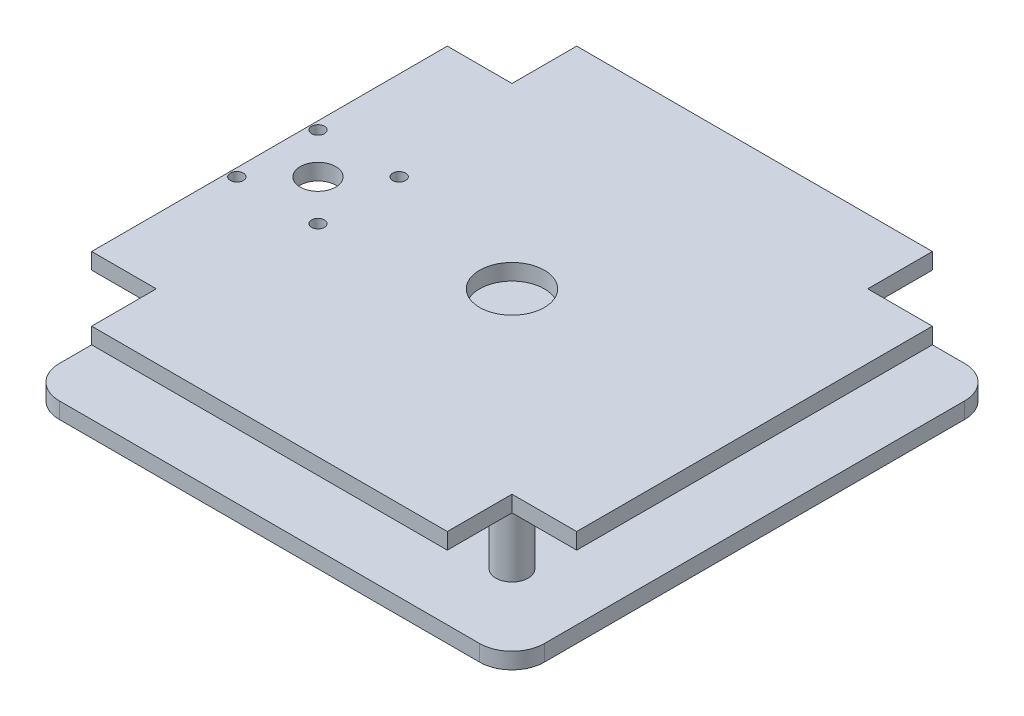
ISO-10303-21;
HEADER;
FILE_DESCRIPTION(('STEP AP214'),'2;1');
FILE_NAME('part.step','',(''),(''),'','','');
FILE_SCHEMA(('AUTOMOTIVE_DESIGN { 1 0 10303 214 1 1 1 1 }'));
ENDSEC;
DATA;
#1=APPLICATION_CONTEXT('core data for automotive mechanical design processes');
#2=APPLICATION_PROTOCOL_DEFINITION('international standard','automotive_design',2000,#1);
#3=PRODUCT_CONTEXT('',#1,'mechanical');
#4=PRODUCT('Part','Part','',(#3));
#5=PRODUCT_RELATED_PRODUCT_CATEGORY('part','',(#4));
#6=PRODUCT_DEFINITION_FORMATION('','',#4);
#7=PRODUCT_DEFINITION_CONTEXT('part definition',#1,'design');
#8=PRODUCT_DEFINITION('design','',#6,#7);
#9=PRODUCT_DEFINITION_SHAPE('','',#8);
#10=(LENGTH_UNIT() NAMED_UNIT(*) SI_UNIT(.MILLI.,.METRE.));
#11=(NAMED_UNIT(*) PLANE_ANGLE_UNIT() SI_UNIT($,.RADIAN.));
#12=(NAMED_UNIT(*) SI_UNIT($,.STERADIAN.) SOLID_ANGLE_UNIT());
#13=UNCERTAINTY_MEASURE_WITH_UNIT(LENGTH_MEASURE(1.E-05),#10,'distance_accuracy_value','');
#14=(GEOMETRIC_REPRESENTATION_CONTEXT(3) GLOBAL_UNCERTAINTY_ASSIGNED_CONTEXT((#13)) GLOBAL_UNIT_ASSIGNED_CONTEXT((#10,
#11,#12)) REPRESENTATION_CONTEXT('',''));
#15=CARTESIAN_POINT('',(0.,0.,0.));
#16=DIRECTION('',(0.,0.,1.));
#17=DIRECTION('',(1.,0.,0.));
#18=AXIS2_PLACEMENT_3D('',#15,#16,#17);
#19=CARTESIAN_POINT('',(75.,5.,-75.));
#20=DIRECTION('',(-1.,0.,0.));
#21=DIRECTION('',(0.,0.,1.));
#22=AXIS2_PLACEMENT_3D('',#19,#20,#21);
#23=PLANE('',#22);
#24=DIRECTION('',(0.,0.,-1.));
#25=VECTOR('',#24,1.);
#26=CARTESIAN_POINT('',(75.,5.,-75.));
#27=LINE('',#26,#25);
#28=CARTESIAN_POINT('',(75.,5.,65.));
#29=VERTEX_POINT('',#28);
#30=CARTESIAN_POINT('',(75.,5.,-65.));
#31=VERTEX_POINT('',#30);
#32=EDGE_CURVE('E267',#29,#31,#27,.T.);
#33=ORIENTED_EDGE('',*,*,#32,.F.);
#34=DIRECTION('',(0.,-1.,0.));
#35=VECTOR('',#34,1.);
#36=CARTESIAN_POINT('',(75.,5.,65.));
#37=LINE('',#36,#35);
#38=CARTESIAN_POINT('',(75.,0.,65.));
#39=VERTEX_POINT('',#38);
#40=EDGE_CURVE('E320',#29,#39,#37,.T.);
#41=ORIENTED_EDGE('',*,*,#40,.T.);
#42=DIRECTION('',(0.,0.,-1.));
#43=VECTOR('',#42,1.);
#44=CARTESIAN_POINT('',(75.,0.,-75.));
#45=LINE('',#44,#43);
#46=CARTESIAN_POINT('',(75.,0.,-65.));
#47=VERTEX_POINT('',#46);
#48=EDGE_CURVE('E264',#39,#47,#45,.T.);
#49=ORIENTED_EDGE('',*,*,#48,.T.);
#50=DIRECTION('',(0.,-1.,0.));
#51=VECTOR('',#50,1.);
#52=CARTESIAN_POINT('',(75.,5.,-65.));
#53=LINE('',#52,#51);
#54=EDGE_CURVE('E318',#47,#31,#53,.F.);
#55=ORIENTED_EDGE('',*,*,#54,.T.);
#56=EDGE_LOOP('',(#33,#41,#49,#55));
#57=FACE_BOUND('',#56,.T.);
#58=ADVANCED_FACE('F43',(#57),#23,.F.);
#59=CARTESIAN_POINT('',(-75.,5.,-75.));
#60=DIRECTION('',(0.,0.,1.));
#61=DIRECTION('',(1.,0.,0.));
#62=AXIS2_PLACEMENT_3D('',#59,#60,#61);
#63=PLANE('',#62);
#64=DIRECTION('',(-1.,0.,0.));
#65=VECTOR('',#64,1.);
#66=CARTESIAN_POINT('',(-75.,5.,-75.));
#67=LINE('',#66,#65);
#68=CARTESIAN_POINT('',(65.,5.,-75.));
#69=VERTEX_POINT('',#68);
#70=CARTESIAN_POINT('',(-65.,5.,-75.));
#71=VERTEX_POINT('',#70);
#72=EDGE_CURVE('E270',#69,#71,#67,.T.);
#73=ORIENTED_EDGE('',*,*,#72,.F.);
#74=DIRECTION('',(0.,-1.,0.));
#75=VECTOR('',#74,1.);
#76=CARTESIAN_POINT('',(65.,5.,-75.));
#77=LINE('',#76,#75);
#78=CARTESIAN_POINT('',(65.,0.,-75.));
#79=VERTEX_POINT('',#78);
#80=EDGE_CURVE('E325',#69,#79,#77,.T.);
#81=ORIENTED_EDGE('',*,*,#80,.T.);
#82=DIRECTION('',(-1.,0.,0.));
#83=VECTOR('',#82,1.);
#84=CARTESIAN_POINT('',(-75.,0.,-75.));
#85=LINE('',#84,#83);
#86=CARTESIAN_POINT('',(-65.,0.,-75.));
#87=VERTEX_POINT('',#86);
#88=EDGE_CURVE('E283',#79,#87,#85,.T.);
#89=ORIENTED_EDGE('',*,*,#88,.T.);
#90=DIRECTION('',(0.,-1.,0.));
#91=VECTOR('',#90,1.);
#92=CARTESIAN_POINT('',(-65.,5.,-75.));
#93=LINE('',#92,#91);
#94=EDGE_CURVE('E323',#87,#71,#93,.F.);
#95=ORIENTED_EDGE('',*,*,#94,.T.);
#96=EDGE_LOOP('',(#73,#81,#89,#95));
#97=FACE_BOUND('',#96,.T.);
#98=ADVANCED_FACE('F475',(#97),#63,.F.);
#99=CARTESIAN_POINT('',(-75.,5.,-75.));
#100=DIRECTION('',(1.,0.,0.));
#101=DIRECTION('',(0.,0.,-1.));
#102=AXIS2_PLACEMENT_3D('',#99,#100,#101);
#103=PLANE('',#102);
#104=DIRECTION('',(0.,0.,1.));
#105=VECTOR('',#104,1.);
#106=CARTESIAN_POINT('',(-75.,0.,-75.));
#107=LINE('',#106,#105);
#108=CARTESIAN_POINT('',(-75.,0.,-65.));
#109=VERTEX_POINT('',#108);
#110=CARTESIAN_POINT('',(-75.,0.,65.));
#111=VERTEX_POINT('',#110);
#112=EDGE_CURVE('E286',#109,#111,#107,.T.);
#113=ORIENTED_EDGE('',*,*,#112,.T.);
#114=DIRECTION('',(0.,-1.,0.));
#115=VECTOR('',#114,1.);
#116=CARTESIAN_POINT('',(-75.,5.,65.));
#117=LINE('',#116,#115);
#118=CARTESIAN_POINT('',(-75.,5.,65.));
#119=VERTEX_POINT('',#118);
#120=EDGE_CURVE('E308',#111,#119,#117,.F.);
#121=ORIENTED_EDGE('',*,*,#120,.T.);
#122=DIRECTION('',(0.,0.,1.));
#123=VECTOR('',#122,1.);
#124=CARTESIAN_POINT('',(-75.,5.,-75.));
#125=LINE('',#124,#123);
#126=CARTESIAN_POINT('',(-75.,5.,-65.));
#127=VERTEX_POINT('',#126);
#128=EDGE_CURVE('E274',#127,#119,#125,.T.);
#129=ORIENTED_EDGE('',*,*,#128,.F.);
#130=DIRECTION('',(0.,-1.,0.));
#131=VECTOR('',#130,1.);
#132=CARTESIAN_POINT('',(-75.,5.,-65.));
#133=LINE('',#132,#131);
#134=EDGE_CURVE('E305',#127,#109,#133,.T.);
#135=ORIENTED_EDGE('',*,*,#134,.T.);
#136=EDGE_LOOP('',(#113,#121,#129,#135));
#137=FACE_BOUND('',#136,.T.);
#138=ADVANCED_FACE('F478',(#137),#103,.F.);
#139=CARTESIAN_POINT('',(-75.,5.,75.));
#140=DIRECTION('',(0.,0.,-1.));
#141=DIRECTION('',(-1.,0.,0.));
#142=AXIS2_PLACEMENT_3D('',#139,#140,#141);
#143=PLANE('',#142);
#144=DIRECTION('',(1.,0.,0.));
#145=VECTOR('',#144,1.);
#146=CARTESIAN_POINT('',(-75.,5.,75.));
#147=LINE('',#146,#145);
#148=CARTESIAN_POINT('',(-65.,5.,75.));
#149=VERTEX_POINT('',#148);
#150=CARTESIAN_POINT('',(65.,5.,75.));
#151=VERTEX_POINT('',#150);
#152=EDGE_CURVE('E277',#149,#151,#147,.T.);
#153=ORIENTED_EDGE('',*,*,#152,.F.);
#154=DIRECTION('',(0.,-1.,0.));
#155=VECTOR('',#154,1.);
#156=CARTESIAN_POINT('',(-65.,5.,75.));
#157=LINE('',#156,#155);
#158=CARTESIAN_POINT('',(-65.,0.,75.));
#159=VERTEX_POINT('',#158);
#160=EDGE_CURVE('E294',#149,#159,#157,.T.);
#161=ORIENTED_EDGE('',*,*,#160,.T.);
#162=DIRECTION('',(1.,0.,0.));
#163=VECTOR('',#162,1.);
#164=CARTESIAN_POINT('',(-75.,0.,75.));
#165=LINE('',#164,#163);
#166=CARTESIAN_POINT('',(65.,0.,75.));
#167=VERTEX_POINT('',#166);
#168=EDGE_CURVE('E271',#159,#167,#165,.T.);
#169=ORIENTED_EDGE('',*,*,#168,.T.);
#170=DIRECTION('',(0.,-1.,0.));
#171=VECTOR('',#170,1.);
#172=CARTESIAN_POINT('',(65.,5.,75.));
#173=LINE('',#172,#171);
#174=EDGE_CURVE('E280',#167,#151,#173,.F.);
#175=ORIENTED_EDGE('',*,*,#174,.T.);
#176=EDGE_LOOP('',(#153,#161,#169,#175));
#177=FACE_BOUND('',#176,.T.);
#178=ADVANCED_FACE('F436',(#177),#143,.F.);
#179=CARTESIAN_POINT('',(0.,5.,0.));
#180=DIRECTION('',(0.,1.,0.));
#181=DIRECTION('',(0.,0.,1.));
#182=AXIS2_PLACEMENT_3D('',#179,#180,#181);
#183=PLANE('',#182);
#184=CARTESIAN_POINT('',(-60.,5.,0.));
#185=DIRECTION('',(0.,1.,0.));
#186=DIRECTION('',(0.,0.,1.));
#187=AXIS2_PLACEMENT_3D('',#184,#185,#186);
#188=CIRCLE('',#187,5.5);
#189=CARTESIAN_POINT('',(-60.,5.,5.5));
#190=VERTEX_POINT('',#189);
#191=EDGE_CURVE('E224',#190,#190,#188,.T.);
#192=ORIENTED_EDGE('',*,*,#191,.F.);
#193=EDGE_LOOP('',(#192));
#194=FACE_BOUND('',#193,.T.);
#195=CARTESIAN_POINT('',(0.,5.,0.));
#196=DIRECTION('',(0.,1.,0.));
#197=DIRECTION('',(0.,0.,1.));
#198=AXIS2_PLACEMENT_3D('',#195,#196,#197);
#199=CIRCLE('',#198,10.);
#200=CARTESIAN_POINT('',(0.,5.,10.));
#201=VERTEX_POINT('',#200);
#202=EDGE_CURVE('E240',#201,#201,#199,.T.);
#203=ORIENTED_EDGE('',*,*,#202,.F.);
#204=EDGE_LOOP('',(#203));
#205=FACE_BOUND('',#204,.T.);
#206=CARTESIAN_POINT('',(-50.,5.,-49.9999999999972));
#207=DIRECTION('',(0.,1.,0.));
#208=DIRECTION('',(0.,0.,1.));
#209=AXIS2_PLACEMENT_3D('',#206,#207,#208);
#210=CIRCLE('',#209,5.000000000003);
#211=CARTESIAN_POINT('',(-50.,5.,-44.9999999999942));
#212=VERTEX_POINT('',#211);
#213=EDGE_CURVE('E239',#212,#212,#210,.T.);
#214=ORIENTED_EDGE('',*,*,#213,.F.);
#215=EDGE_LOOP('',(#214));
#216=FACE_BOUND('',#215,.T.);
#217=CARTESIAN_POINT('',(-49.9999999999972,5.,50.0000000000028));
#218=DIRECTION('',(0.,1.,0.));
#219=DIRECTION('',(0.,0.,1.));
#220=AXIS2_PLACEMENT_3D('',#217,#218,#219);
#221=CIRCLE('',#220,5.00000000000206);
#222=CARTESIAN_POINT('',(-49.9999999999972,5.,55.0000000000049));
#223=VERTEX_POINT('',#222);
#224=EDGE_CURVE('E246',#223,#223,#221,.T.);
#225=ORIENTED_EDGE('',*,*,#224,.F.);
#226=EDGE_LOOP('',(#225));
#227=FACE_BOUND('',#226,.T.);
#228=CARTESIAN_POINT('',(50.0000000000028,5.,50.));
#229=DIRECTION('',(0.,1.,0.));
#230=DIRECTION('',(0.,0.,1.));
#231=AXIS2_PLACEMENT_3D('',#228,#229,#230);
#232=CIRCLE('',#231,4.99999999999929);
#233=CARTESIAN_POINT('',(50.0000000000028,5.,54.9999999999993));
#234=VERTEX_POINT('',#233);
#235=EDGE_CURVE('E252',#234,#234,#232,.T.);
#236=ORIENTED_EDGE('',*,*,#235,.F.);
#237=EDGE_LOOP('',(#236));
#238=FACE_BOUND('',#237,.T.);
#239=CARTESIAN_POINT('',(50.,5.,-50.));
#240=DIRECTION('',(0.,1.,0.));
#241=DIRECTION('',(0.,0.,1.));
#242=AXIS2_PLACEMENT_3D('',#239,#240,#241);
#243=CIRCLE('',#242,5.);
#244=CARTESIAN_POINT('',(50.,5.,-45.));
#245=VERTEX_POINT('',#244);
#246=EDGE_CURVE('E258',#245,#245,#243,.T.);
#247=ORIENTED_EDGE('',*,*,#246,.F.);
#248=EDGE_LOOP('',(#247));
#249=FACE_BOUND('',#248,.T.);
#250=ORIENTED_EDGE('',*,*,#128,.T.);
#251=CARTESIAN_POINT('',(-65.,5.,65.));
#252=DIRECTION('',(0.,1.,0.));
#253=DIRECTION('',(0.,0.,1.));
#254=AXIS2_PLACEMENT_3D('',#251,#252,#253);
#255=CIRCLE('',#254,10.);
#256=EDGE_CURVE('E316',#119,#149,#255,.T.);
#257=ORIENTED_EDGE('',*,*,#256,.T.);
#258=ORIENTED_EDGE('',*,*,#152,.T.);
#259=CARTESIAN_POINT('',(65.,5.,65.));
#260=DIRECTION('',(0.,1.,0.));
#261=DIRECTION('',(0.,0.,1.));
#262=AXIS2_PLACEMENT_3D('',#259,#260,#261);
#263=CIRCLE('',#262,10.);
#264=EDGE_CURVE('E314',#151,#29,#263,.T.);
#265=ORIENTED_EDGE('',*,*,#264,.T.);
#266=ORIENTED_EDGE('',*,*,#32,.T.);
#267=CARTESIAN_POINT('',(65.,5.,-65.));
#268=DIRECTION('',(0.,1.,0.));
#269=DIRECTION('',(0.,0.,1.));
#270=AXIS2_PLACEMENT_3D('',#267,#268,#269);
#271=CIRCLE('',#270,10.);
#272=EDGE_CURVE('E312',#31,#69,#271,.T.);
#273=ORIENTED_EDGE('',*,*,#272,.T.);
#274=ORIENTED_EDGE('',*,*,#72,.T.);
#275=CARTESIAN_POINT('',(-65.,5.,-65.));
#276=DIRECTION('',(0.,1.,0.));
#277=DIRECTION('',(0.,0.,1.));
#278=AXIS2_PLACEMENT_3D('',#275,#276,#277);
#279=CIRCLE('',#278,10.);
#280=EDGE_CURVE('E310',#71,#127,#279,.T.);
#281=ORIENTED_EDGE('',*,*,#280,.T.);
#282=EDGE_LOOP('',(#250,#257,#258,#265,#266,#273,#274,#281));
#283=FACE_BOUND('',#282,.T.);
#284=ADVANCED_FACE('F432',(#194,#205,#216,#227,#238,#249,#283),#183,.T.);
#285=CARTESIAN_POINT('',(0.,0.,0.));
#286=DIRECTION('',(0.,1.,0.));
#287=DIRECTION('',(0.,0.,1.));
#288=AXIS2_PLACEMENT_3D('',#285,#286,#287);
#289=PLANE('',#288);
#290=CARTESIAN_POINT('',(-60.,0.,0.));
#291=DIRECTION('',(0.,1.,0.));
#292=DIRECTION('',(0.,0.,1.));
#293=AXIS2_PLACEMENT_3D('',#290,#291,#292);
#294=CIRCLE('',#293,5.5);
#295=CARTESIAN_POINT('',(-60.,0.,5.5));
#296=VERTEX_POINT('',#295);
#297=EDGE_CURVE('E235',#296,#296,#294,.T.);
#298=ORIENTED_EDGE('',*,*,#297,.T.);
#299=EDGE_LOOP('',(#298));
#300=FACE_BOUND('',#299,.T.);
#301=CARTESIAN_POINT('',(0.,0.,0.));
#302=DIRECTION('',(0.,1.,0.));
#303=DIRECTION('',(0.,0.,1.));
#304=AXIS2_PLACEMENT_3D('',#301,#302,#303);
#305=CIRCLE('',#304,10.);
#306=CARTESIAN_POINT('',(0.,0.,10.));
#307=VERTEX_POINT('',#306);
#308=EDGE_CURVE('E236',#307,#307,#305,.T.);
#309=ORIENTED_EDGE('',*,*,#308,.T.);
#310=EDGE_LOOP('',(#309));
#311=FACE_BOUND('',#310,.T.);
#312=ORIENTED_EDGE('',*,*,#168,.F.);
#313=CARTESIAN_POINT('',(-65.,0.,65.));
#314=DIRECTION('',(0.,1.,0.));
#315=DIRECTION('',(0.,0.,1.));
#316=AXIS2_PLACEMENT_3D('',#313,#314,#315);
#317=CIRCLE('',#316,10.);
#318=EDGE_CURVE('E303',#159,#111,#317,.F.);
#319=ORIENTED_EDGE('',*,*,#318,.T.);
#320=ORIENTED_EDGE('',*,*,#112,.F.);
#321=CARTESIAN_POINT('',(-65.,0.,-65.));
#322=DIRECTION('',(0.,1.,0.));
#323=DIRECTION('',(0.,0.,1.));
#324=AXIS2_PLACEMENT_3D('',#321,#322,#323);
#325=CIRCLE('',#324,10.);
#326=EDGE_CURVE('E297',#109,#87,#325,.F.);
#327=ORIENTED_EDGE('',*,*,#326,.T.);
#328=ORIENTED_EDGE('',*,*,#88,.F.);
#329=CARTESIAN_POINT('',(65.,0.,-65.));
#330=DIRECTION('',(0.,1.,0.));
#331=DIRECTION('',(0.,0.,1.));
#332=AXIS2_PLACEMENT_3D('',#329,#330,#331);
#333=CIRCLE('',#332,10.);
#334=EDGE_CURVE('E299',#79,#47,#333,.F.);
#335=ORIENTED_EDGE('',*,*,#334,.T.);
#336=ORIENTED_EDGE('',*,*,#48,.F.);
#337=CARTESIAN_POINT('',(65.,0.,65.));
#338=DIRECTION('',(0.,1.,0.));
#339=DIRECTION('',(0.,0.,1.));
#340=AXIS2_PLACEMENT_3D('',#337,#338,#339);
#341=CIRCLE('',#340,10.);
#342=EDGE_CURVE('E301',#39,#167,#341,.F.);
#343=ORIENTED_EDGE('',*,*,#342,.T.);
#344=EDGE_LOOP('',(#312,#319,#320,#327,#328,#335,#336,#343));
#345=FACE_BOUND('',#344,.T.);
#346=ADVANCED_FACE('F435',(#300,#311,#345),#289,.F.);
#347=CARTESIAN_POINT('',(50.,25.,-50.));
#348=DIRECTION('',(0.,-1.,0.));
#349=DIRECTION('',(0.,0.,-1.));
#350=AXIS2_PLACEMENT_3D('',#347,#348,#349);
#351=CYLINDRICAL_SURFACE('',#350,5.);
#352=CARTESIAN_POINT('',(50.,25.,-50.));
#353=DIRECTION('',(0.,1.,0.));
#354=DIRECTION('',(0.,0.,1.));
#355=AXIS2_PLACEMENT_3D('',#352,#353,#354);
#356=CIRCLE('',#355,5.);
#357=CARTESIAN_POINT('',(50.,25.,-45.));
#358=VERTEX_POINT('',#357);
#359=EDGE_CURVE('E261',#358,#358,#356,.T.);
#360=ORIENTED_EDGE('',*,*,#359,.F.);
#361=EDGE_LOOP('',(#360));
#362=FACE_BOUND('',#361,.T.);
#363=ORIENTED_EDGE('',*,*,#246,.T.);
#364=EDGE_LOOP('',(#363));
#365=FACE_BOUND('',#364,.T.);
#366=ADVANCED_FACE('F524',(#362,#365),#351,.T.);
#367=CARTESIAN_POINT('',(50.0000000000028,25.,50.));
#368=DIRECTION('',(0.,-1.,0.));
#369=DIRECTION('',(0.,0.,-1.));
#370=AXIS2_PLACEMENT_3D('',#367,#368,#369);
#371=CYLINDRICAL_SURFACE('',#370,4.99999999999929);
#372=CARTESIAN_POINT('',(50.0000000000028,25.,50.));
#373=DIRECTION('',(0.,1.,0.));
#374=DIRECTION('',(0.,0.,1.));
#375=AXIS2_PLACEMENT_3D('',#372,#373,#374);
#376=CIRCLE('',#375,4.99999999999929);
#377=CARTESIAN_POINT('',(50.0000000000028,25.,54.9999999999993));
#378=VERTEX_POINT('',#377);
#379=EDGE_CURVE('E255',#378,#378,#376,.T.);
#380=ORIENTED_EDGE('',*,*,#379,.F.);
#381=EDGE_LOOP('',(#380));
#382=FACE_BOUND('',#381,.T.);
#383=ORIENTED_EDGE('',*,*,#235,.T.);
#384=EDGE_LOOP('',(#383));
#385=FACE_BOUND('',#384,.T.);
#386=ADVANCED_FACE('F520',(#382,#385),#371,.T.);
#387=CARTESIAN_POINT('',(-49.9999999999972,25.,50.0000000000028));
#388=DIRECTION('',(0.,-1.,0.));
#389=DIRECTION('',(0.,0.,-1.));
#390=AXIS2_PLACEMENT_3D('',#387,#388,#389);
#391=CYLINDRICAL_SURFACE('',#390,5.00000000000206);
#392=CARTESIAN_POINT('',(-49.9999999999972,25.,50.0000000000028));
#393=DIRECTION('',(0.,1.,0.));
#394=DIRECTION('',(0.,0.,1.));
#395=AXIS2_PLACEMENT_3D('',#392,#393,#394);
#396=CIRCLE('',#395,5.00000000000206);
#397=CARTESIAN_POINT('',(-49.9999999999972,25.,55.0000000000049));
#398=VERTEX_POINT('',#397);
#399=EDGE_CURVE('E249',#398,#398,#396,.T.);
#400=ORIENTED_EDGE('',*,*,#399,.F.);
#401=EDGE_LOOP('',(#400));
#402=FACE_BOUND('',#401,.T.);
#403=ORIENTED_EDGE('',*,*,#224,.T.);
#404=EDGE_LOOP('',(#403));
#405=FACE_BOUND('',#404,.T.);
#406=ADVANCED_FACE('F428',(#402,#405),#391,.T.);
#407=CARTESIAN_POINT('',(-50.,25.,-49.9999999999972));
#408=DIRECTION('',(0.,-1.,0.));
#409=DIRECTION('',(0.,0.,-1.));
#410=AXIS2_PLACEMENT_3D('',#407,#408,#409);
#411=CYLINDRICAL_SURFACE('',#410,5.000000000003);
#412=CARTESIAN_POINT('',(-50.,25.,-49.9999999999972));
#413=DIRECTION('',(0.,1.,0.));
#414=DIRECTION('',(0.,0.,1.));
#415=AXIS2_PLACEMENT_3D('',#412,#413,#414);
#416=CIRCLE('',#415,5.000000000003);
#417=CARTESIAN_POINT('',(-50.,25.,-44.9999999999942));
#418=VERTEX_POINT('',#417);
#419=EDGE_CURVE('E243',#418,#418,#416,.T.);
#420=ORIENTED_EDGE('',*,*,#419,.F.);
#421=EDGE_LOOP('',(#420));
#422=FACE_BOUND('',#421,.T.);
#423=ORIENTED_EDGE('',*,*,#213,.T.);
#424=EDGE_LOOP('',(#423));
#425=FACE_BOUND('',#424,.T.);
#426=ADVANCED_FACE('F424',(#422,#425),#411,.T.);
#427=CARTESIAN_POINT('',(0.,0.,0.));
#428=DIRECTION('',(0.,1.,0.));
#429=DIRECTION('',(0.,0.,1.));
#430=AXIS2_PLACEMENT_3D('',#427,#428,#429);
#431=CYLINDRICAL_SURFACE('',#430,10.);
#432=ORIENTED_EDGE('',*,*,#308,.F.);
#433=EDGE_LOOP('',(#432));
#434=FACE_BOUND('',#433,.T.);
#435=ORIENTED_EDGE('',*,*,#202,.T.);
#436=EDGE_LOOP('',(#435));
#437=FACE_BOUND('',#436,.T.);
#438=ADVANCED_FACE('F427',(#434,#437),#431,.F.);
#439=CARTESIAN_POINT('',(-60.,-15.,0.));
#440=DIRECTION('',(0.,1.,0.));
#441=DIRECTION('',(0.,0.,1.));
#442=AXIS2_PLACEMENT_3D('',#439,#440,#441);
#443=CYLINDRICAL_SURFACE('',#442,5.5);
#444=ORIENTED_EDGE('',*,*,#191,.T.);
#445=EDGE_LOOP('',(#444));
#446=FACE_BOUND('',#445,.T.);
#447=ORIENTED_EDGE('',*,*,#297,.F.);
#448=EDGE_LOOP('',(#447));
#449=FACE_BOUND('',#448,.T.);
#450=ADVANCED_FACE('F494',(#446,#449),#443,.F.);
#451=CARTESIAN_POINT('',(-65.,5.,65.));
#452=DIRECTION('',(0.,-1.,0.));
#453=DIRECTION('',(0.,0.,-1.));
#454=AXIS2_PLACEMENT_3D('',#451,#452,#453);
#455=CYLINDRICAL_SURFACE('',#454,10.);
#456=ORIENTED_EDGE('',*,*,#256,.F.);
#457=ORIENTED_EDGE('',*,*,#120,.F.);
#458=ORIENTED_EDGE('',*,*,#318,.F.);
#459=ORIENTED_EDGE('',*,*,#160,.F.);
#460=EDGE_LOOP('',(#456,#457,#458,#459));
#461=FACE_BOUND('',#460,.T.);
#462=ADVANCED_FACE('F454',(#461),#455,.T.);
#463=CARTESIAN_POINT('',(65.,5.,65.));
#464=DIRECTION('',(0.,-1.,0.));
#465=DIRECTION('',(0.,0.,-1.));
#466=AXIS2_PLACEMENT_3D('',#463,#464,#465);
#467=CYLINDRICAL_SURFACE('',#466,10.);
#468=ORIENTED_EDGE('',*,*,#264,.F.);
#469=ORIENTED_EDGE('',*,*,#174,.F.);
#470=ORIENTED_EDGE('',*,*,#342,.F.);
#471=ORIENTED_EDGE('',*,*,#40,.F.);
#472=EDGE_LOOP('',(#468,#469,#470,#471));
#473=FACE_BOUND('',#472,.T.);
#474=ADVANCED_FACE('F464',(#473),#467,.T.);
#475=CARTESIAN_POINT('',(65.,5.,-65.));
#476=DIRECTION('',(0.,-1.,0.));
#477=DIRECTION('',(0.,0.,-1.));
#478=AXIS2_PLACEMENT_3D('',#475,#476,#477);
#479=CYLINDRICAL_SURFACE('',#478,10.);
#480=ORIENTED_EDGE('',*,*,#272,.F.);
#481=ORIENTED_EDGE('',*,*,#54,.F.);
#482=ORIENTED_EDGE('',*,*,#334,.F.);
#483=ORIENTED_EDGE('',*,*,#80,.F.);
#484=EDGE_LOOP('',(#480,#481,#482,#483));
#485=FACE_BOUND('',#484,.T.);
#486=ADVANCED_FACE('F472',(#485),#479,.T.);
#487=CARTESIAN_POINT('',(-65.,5.,-65.));
#488=DIRECTION('',(0.,-1.,0.));
#489=DIRECTION('',(0.,0.,-1.));
#490=AXIS2_PLACEMENT_3D('',#487,#488,#489);
#491=CYLINDRICAL_SURFACE('',#490,10.);
#492=ORIENTED_EDGE('',*,*,#280,.F.);
#493=ORIENTED_EDGE('',*,*,#94,.F.);
#494=ORIENTED_EDGE('',*,*,#326,.F.);
#495=ORIENTED_EDGE('',*,*,#134,.F.);
#496=EDGE_LOOP('',(#492,#493,#494,#495));
#497=FACE_BOUND('',#496,.T.);
#498=ADVANCED_FACE('F45',(#497),#491,.T.);
#499=CARTESIAN_POINT('',(0.,30.,-75.));
#500=DIRECTION('',(0.,0.,1.));
#501=DIRECTION('',(1.,0.,0.));
#502=AXIS2_PLACEMENT_3D('',#499,#500,#501);
#503=PLANE('',#502);
#504=DIRECTION('',(-1.,0.,0.));
#505=VECTOR('',#504,1.);
#506=CARTESIAN_POINT('',(0.,30.,-75.));
#507=LINE('',#506,#505);
#508=CARTESIAN_POINT('',(55.,30.,-75.0000000000125));
#509=VERTEX_POINT('',#508);
#510=CARTESIAN_POINT('',(-55.,30.,-75.));
#511=VERTEX_POINT('',#510);
#512=EDGE_CURVE('E200',#509,#511,#507,.T.);
#513=ORIENTED_EDGE('',*,*,#512,.F.);
#514=DIRECTION('',(0.,1.,0.));
#515=VECTOR('',#514,1.);
#516=CARTESIAN_POINT('',(55.,20.,-75.0000000000125));
#517=LINE('',#516,#515);
#518=CARTESIAN_POINT('',(55.,25.,-75.0000000000125));
#519=VERTEX_POINT('',#518);
#520=EDGE_CURVE('E180',#519,#509,#517,.T.);
#521=ORIENTED_EDGE('',*,*,#520,.F.);
#522=DIRECTION('',(-1.,0.,0.));
#523=VECTOR('',#522,1.);
#524=CARTESIAN_POINT('',(0.,25.,-75.));
#525=LINE('',#524,#523);
#526=CARTESIAN_POINT('',(-55.,25.,-75.));
#527=VERTEX_POINT('',#526);
#528=EDGE_CURVE('E225',#519,#527,#525,.T.);
#529=ORIENTED_EDGE('',*,*,#528,.T.);
#530=DIRECTION('',(0.,1.,0.));
#531=VECTOR('',#530,1.);
#532=CARTESIAN_POINT('',(-55.,20.,-75.));
#533=LINE('',#532,#531);
#534=EDGE_CURVE('E206',#527,#511,#533,.T.);
#535=ORIENTED_EDGE('',*,*,#534,.T.);
#536=EDGE_LOOP('',(#513,#521,#529,#535));
#537=FACE_BOUND('',#536,.T.);
#538=ADVANCED_FACE('F205',(#537),#503,.F.);
#539=CARTESIAN_POINT('',(-75.,30.,0.));
#540=DIRECTION('',(1.,0.,0.));
#541=DIRECTION('',(0.,0.,-1.));
#542=AXIS2_PLACEMENT_3D('',#539,#540,#541);
#543=PLANE('',#542);
#544=DIRECTION('',(0.,0.,1.));
#545=VECTOR('',#544,1.);
#546=CARTESIAN_POINT('',(-75.,25.,0.));
#547=LINE('',#546,#545);
#548=CARTESIAN_POINT('',(-75.,25.,-55.));
#549=VERTEX_POINT('',#548);
#550=CARTESIAN_POINT('',(-74.9999999999875,25.,55.));
#551=VERTEX_POINT('',#550);
#552=EDGE_CURVE('E227',#549,#551,#547,.T.);
#553=ORIENTED_EDGE('',*,*,#552,.T.);
#554=DIRECTION('',(0.,1.,0.));
#555=VECTOR('',#554,1.);
#556=CARTESIAN_POINT('',(-74.9999999999875,20.,55.));
#557=LINE('',#556,#555);
#558=CARTESIAN_POINT('',(-74.9999999999875,30.,55.));
#559=VERTEX_POINT('',#558);
#560=EDGE_CURVE('E358',#551,#559,#557,.T.);
#561=ORIENTED_EDGE('',*,*,#560,.T.);
#562=DIRECTION('',(0.,0.,1.));
#563=VECTOR('',#562,1.);
#564=CARTESIAN_POINT('',(-75.,30.,0.));
#565=LINE('',#564,#563);
#566=CARTESIAN_POINT('',(-75.,30.,-55.));
#567=VERTEX_POINT('',#566);
#568=EDGE_CURVE('E207',#567,#559,#565,.T.);
#569=ORIENTED_EDGE('',*,*,#568,.F.);
#570=DIRECTION('',(0.,1.,0.));
#571=VECTOR('',#570,1.);
#572=CARTESIAN_POINT('',(-75.,20.,-55.));
#573=LINE('',#572,#571);
#574=EDGE_CURVE('E370',#549,#567,#573,.T.);
#575=ORIENTED_EDGE('',*,*,#574,.F.);
#576=EDGE_LOOP('',(#553,#561,#569,#575));
#577=FACE_BOUND('',#576,.T.);
#578=ADVANCED_FACE('F503',(#577),#543,.F.);
#579=CARTESIAN_POINT('',(0.,30.,75.));
#580=DIRECTION('',(0.,0.,-1.));
#581=DIRECTION('',(-1.,0.,0.));
#582=AXIS2_PLACEMENT_3D('',#579,#580,#581);
#583=PLANE('',#582);
#584=DIRECTION('',(1.,0.,0.));
#585=VECTOR('',#584,1.);
#586=CARTESIAN_POINT('',(0.,30.,75.));
#587=LINE('',#586,#585);
#588=CARTESIAN_POINT('',(-54.9999999999875,30.,75.0000000000001));
#589=VERTEX_POINT('',#588);
#590=CARTESIAN_POINT('',(55.0000000000125,30.,74.9999999999876));
#591=VERTEX_POINT('',#590);
#592=EDGE_CURVE('E211',#589,#591,#587,.T.);
#593=ORIENTED_EDGE('',*,*,#592,.F.);
#594=DIRECTION('',(0.,1.,0.));
#595=VECTOR('',#594,1.);
#596=CARTESIAN_POINT('',(-54.9999999999875,20.,75.0000000000001));
#597=LINE('',#596,#595);
#598=CARTESIAN_POINT('',(-54.9999999999875,25.,75.0000000000001));
#599=VERTEX_POINT('',#598);
#600=EDGE_CURVE('E350',#599,#589,#597,.T.);
#601=ORIENTED_EDGE('',*,*,#600,.F.);
#602=DIRECTION('',(1.,0.,0.));
#603=VECTOR('',#602,1.);
#604=CARTESIAN_POINT('',(0.,25.,75.));
#605=LINE('',#604,#603);
#606=CARTESIAN_POINT('',(55.0000000000125,25.,74.9999999999876));
#607=VERTEX_POINT('',#606);
#608=EDGE_CURVE('E214',#599,#607,#605,.T.);
#609=ORIENTED_EDGE('',*,*,#608,.T.);
#610=DIRECTION('',(0.,1.,0.));
#611=VECTOR('',#610,1.);
#612=CARTESIAN_POINT('',(55.0000000000125,20.,74.9999999999876));
#613=LINE('',#612,#611);
#614=EDGE_CURVE('E202',#607,#591,#613,.T.);
#615=ORIENTED_EDGE('',*,*,#614,.T.);
#616=EDGE_LOOP('',(#593,#601,#609,#615));
#617=FACE_BOUND('',#616,.T.);
#618=ADVANCED_FACE('F354',(#617),#583,.F.);
#619=CARTESIAN_POINT('',(75.,30.,0.));
#620=DIRECTION('',(-1.,0.,0.));
#621=DIRECTION('',(0.,0.,1.));
#622=AXIS2_PLACEMENT_3D('',#619,#620,#621);
#623=PLANE('',#622);
#624=DIRECTION('',(0.,0.,-1.));
#625=VECTOR('',#624,1.);
#626=CARTESIAN_POINT('',(75.,30.,0.));
#627=LINE('',#626,#625);
#628=CARTESIAN_POINT('',(75.0000000000125,30.,54.9999999999875));
#629=VERTEX_POINT('',#628);
#630=CARTESIAN_POINT('',(75.,30.,-55.0000000000125));
#631=VERTEX_POINT('',#630);
#632=EDGE_CURVE('E222',#629,#631,#627,.T.);
#633=ORIENTED_EDGE('',*,*,#632,.F.);
#634=DIRECTION('',(0.,1.,0.));
#635=VECTOR('',#634,1.);
#636=CARTESIAN_POINT('',(75.0000000000125,20.,54.9999999999875));
#637=LINE('',#636,#635);
#638=CARTESIAN_POINT('',(75.0000000000125,25.,54.9999999999875));
#639=VERTEX_POINT('',#638);
#640=EDGE_CURVE('E771',#639,#629,#637,.T.);
#641=ORIENTED_EDGE('',*,*,#640,.F.);
#642=DIRECTION('',(0.,0.,-1.));
#643=VECTOR('',#642,1.);
#644=CARTESIAN_POINT('',(75.,25.,0.));
#645=LINE('',#644,#643);
#646=CARTESIAN_POINT('',(75.,25.,-55.0000000000125));
#647=VERTEX_POINT('',#646);
#648=EDGE_CURVE('E208',#639,#647,#645,.T.);
#649=ORIENTED_EDGE('',*,*,#648,.T.);
#650=DIRECTION('',(0.,1.,0.));
#651=VECTOR('',#650,1.);
#652=CARTESIAN_POINT('',(75.,20.,-55.0000000000125));
#653=LINE('',#652,#651);
#654=EDGE_CURVE('E368',#647,#631,#653,.T.);
#655=ORIENTED_EDGE('',*,*,#654,.T.);
#656=EDGE_LOOP('',(#633,#641,#649,#655));
#657=FACE_BOUND('',#656,.T.);
#658=ADVANCED_FACE('F665',(#657),#623,.F.);
#659=CARTESIAN_POINT('',(0.,30.,0.));
#660=DIRECTION('',(0.,1.,0.));
#661=DIRECTION('',(0.,0.,1.));
#662=AXIS2_PLACEMENT_3D('',#659,#660,#661);
#663=PLANE('',#662);
#664=DIRECTION('',(-1.,0.,0.));
#665=VECTOR('',#664,1.);
#666=CARTESIAN_POINT('',(-54.9999999999875,30.,55.));
#667=LINE('',#666,#665);
#668=CARTESIAN_POINT('',(-54.9999999999875,30.,55.));
#669=VERTEX_POINT('',#668);
#670=EDGE_CURVE('E356',#669,#559,#667,.T.);
#671=ORIENTED_EDGE('',*,*,#670,.F.);
#672=DIRECTION('',(0.,0.,-1.));
#673=VECTOR('',#672,1.);
#674=CARTESIAN_POINT('',(-54.9999999999875,30.,75.0000000000001));
#675=LINE('',#674,#673);
#676=EDGE_CURVE('E360',#589,#669,#675,.T.);
#677=ORIENTED_EDGE('',*,*,#676,.F.);
#678=ORIENTED_EDGE('',*,*,#592,.T.);
#679=DIRECTION('',(0.,0.,1.));
#680=VECTOR('',#679,1.);
#681=CARTESIAN_POINT('',(55.0000000000125,30.,54.9999999999875));
#682=LINE('',#681,#680);
#683=CARTESIAN_POINT('',(55.0000000000125,30.,54.9999999999875));
#684=VERTEX_POINT('',#683);
#685=EDGE_CURVE('E768',#684,#591,#682,.T.);
#686=ORIENTED_EDGE('',*,*,#685,.F.);
#687=DIRECTION('',(-1.,0.,0.));
#688=VECTOR('',#687,1.);
#689=CARTESIAN_POINT('',(75.0000000000125,30.,54.9999999999875));
#690=LINE('',#689,#688);
#691=EDGE_CURVE('E767',#629,#684,#690,.T.);
#692=ORIENTED_EDGE('',*,*,#691,.F.);
#693=ORIENTED_EDGE('',*,*,#632,.T.);
#694=DIRECTION('',(1.,0.,0.));
#695=VECTOR('',#694,1.);
#696=CARTESIAN_POINT('',(55.,30.,-55.0000000000125));
#697=LINE('',#696,#695);
#698=CARTESIAN_POINT('',(55.,30.,-55.0000000000125));
#699=VERTEX_POINT('',#698);
#700=EDGE_CURVE('E192',#699,#631,#697,.T.);
#701=ORIENTED_EDGE('',*,*,#700,.F.);
#702=DIRECTION('',(0.,0.,1.));
#703=VECTOR('',#702,1.);
#704=CARTESIAN_POINT('',(55.,30.,-75.0000000000125));
#705=LINE('',#704,#703);
#706=EDGE_CURVE('E183',#509,#699,#705,.T.);
#707=ORIENTED_EDGE('',*,*,#706,.F.);
#708=ORIENTED_EDGE('',*,*,#512,.T.);
#709=DIRECTION('',(0.,0.,-1.));
#710=VECTOR('',#709,1.);
#711=CARTESIAN_POINT('',(-55.,30.,-55.));
#712=LINE('',#711,#710);
#713=CARTESIAN_POINT('',(-55.,30.,-55.));
#714=VERTEX_POINT('',#713);
#715=EDGE_CURVE('E367',#714,#511,#712,.T.);
#716=ORIENTED_EDGE('',*,*,#715,.F.);
#717=DIRECTION('',(1.,0.,0.));
#718=VECTOR('',#717,1.);
#719=CARTESIAN_POINT('',(-75.,30.,-55.));
#720=LINE('',#719,#718);
#721=EDGE_CURVE('E364',#567,#714,#720,.T.);
#722=ORIENTED_EDGE('',*,*,#721,.F.);
#723=ORIENTED_EDGE('',*,*,#568,.T.);
#724=EDGE_LOOP('',(#671,#677,#678,#686,#692,#693,#701,#707,#708,#716,#722,#723));
#725=FACE_BOUND('',#724,.T.);
#726=CARTESIAN_POINT('',(-72.5511453660611,30.,-12.5511453660609));
#727=DIRECTION('',(0.,1.,0.));
#728=DIRECTION('',(0.,0.,1.));
#729=AXIS2_PLACEMENT_3D('',#726,#727,#728);
#730=CIRCLE('',#729,2.00000000000001);
#731=CARTESIAN_POINT('',(-72.5511453660611,30.,-10.5511453660609));
#732=VERTEX_POINT('',#731);
#733=EDGE_CURVE('E372',#732,#732,#730,.T.);
#734=ORIENTED_EDGE('',*,*,#733,.F.);
#735=EDGE_LOOP('',(#734));
#736=FACE_BOUND('',#735,.T.);
#737=CARTESIAN_POINT('',(-72.5511453660609,30.,12.5511453660615));
#738=DIRECTION('',(0.,1.,0.));
#739=DIRECTION('',(0.,0.,1.));
#740=AXIS2_PLACEMENT_3D('',#737,#738,#739);
#741=CIRCLE('',#740,2.);
#742=CARTESIAN_POINT('',(-72.5511453660609,30.,14.5511453660616));
#743=VERTEX_POINT('',#742);
#744=EDGE_CURVE('E386',#743,#743,#741,.T.);
#745=ORIENTED_EDGE('',*,*,#744,.F.);
#746=EDGE_LOOP('',(#745));
#747=FACE_BOUND('',#746,.T.);
#748=CARTESIAN_POINT('',(-47.4488546339384,30.,12.5511453660612));
#749=DIRECTION('',(0.,1.,0.));
#750=DIRECTION('',(0.,0.,1.));
#751=AXIS2_PLACEMENT_3D('',#748,#749,#750);
#752=CIRCLE('',#751,2.00000000000001);
#753=CARTESIAN_POINT('',(-47.4488546339384,30.,14.5511453660612));
#754=VERTEX_POINT('',#753);
#755=EDGE_CURVE('E380',#754,#754,#752,.T.);
#756=ORIENTED_EDGE('',*,*,#755,.F.);
#757=EDGE_LOOP('',(#756));
#758=FACE_BOUND('',#757,.T.);
#759=CARTESIAN_POINT('',(-47.4488546339389,30.,-12.5511453660613));
#760=DIRECTION('',(0.,1.,0.));
#761=DIRECTION('',(0.,0.,1.));
#762=AXIS2_PLACEMENT_3D('',#759,#760,#761);
#763=CIRCLE('',#762,2.00000000000001);
#764=CARTESIAN_POINT('',(-47.4488546339389,30.,-10.5511453660613));
#765=VERTEX_POINT('',#764);
#766=EDGE_CURVE('E379',#765,#765,#763,.T.);
#767=ORIENTED_EDGE('',*,*,#766,.F.);
#768=EDGE_LOOP('',(#767));
#769=FACE_BOUND('',#768,.T.);
#770=CARTESIAN_POINT('',(0.,30.,0.));
#771=DIRECTION('',(0.,-1.,0.));
#772=DIRECTION('',(0.,0.,-1.));
#773=AXIS2_PLACEMENT_3D('',#770,#771,#772);
#774=CIRCLE('',#773,10.);
#775=CARTESIAN_POINT('',(0.,30.,-10.));
#776=VERTEX_POINT('',#775);
#777=EDGE_CURVE('E228',#776,#776,#774,.T.);
#778=ORIENTED_EDGE('',*,*,#777,.T.);
#779=EDGE_LOOP('',(#778));
#780=FACE_BOUND('',#779,.T.);
#781=CARTESIAN_POINT('',(-60.,30.,0.));
#782=DIRECTION('',(0.,-1.,0.));
#783=DIRECTION('',(0.,0.,-1.));
#784=AXIS2_PLACEMENT_3D('',#781,#782,#783);
#785=CIRCLE('',#784,5.5);
#786=CARTESIAN_POINT('',(-60.,30.,-5.5));
#787=VERTEX_POINT('',#786);
#788=EDGE_CURVE('E403',#787,#787,#785,.T.);
#789=ORIENTED_EDGE('',*,*,#788,.T.);
#790=EDGE_LOOP('',(#789));
#791=FACE_BOUND('',#790,.T.);
#792=ADVANCED_FACE('F197',(#725,#736,#747,#758,#769,#780,#791),#663,.T.);
#793=CARTESIAN_POINT('',(0.,25.,0.));
#794=DIRECTION('',(0.,1.,0.));
#795=DIRECTION('',(0.,0.,1.));
#796=AXIS2_PLACEMENT_3D('',#793,#794,#795);
#797=PLANE('',#796);
#798=CARTESIAN_POINT('',(-72.5511453660611,25.,-12.5511453660609));
#799=DIRECTION('',(0.,1.,0.));
#800=DIRECTION('',(0.,0.,1.));
#801=AXIS2_PLACEMENT_3D('',#798,#799,#800);
#802=CIRCLE('',#801,2.00000000000001);
#803=CARTESIAN_POINT('',(-72.5511453660611,25.,-10.5511453660609));
#804=VERTEX_POINT('',#803);
#805=EDGE_CURVE('E389',#804,#804,#802,.T.);
#806=ORIENTED_EDGE('',*,*,#805,.T.);
#807=EDGE_LOOP('',(#806));
#808=FACE_BOUND('',#807,.T.);
#809=CARTESIAN_POINT('',(-72.5511453660609,25.,12.5511453660615));
#810=DIRECTION('',(0.,1.,0.));
#811=DIRECTION('',(0.,0.,1.));
#812=AXIS2_PLACEMENT_3D('',#809,#810,#811);
#813=CIRCLE('',#812,2.);
#814=CARTESIAN_POINT('',(-72.5511453660609,25.,14.5511453660616));
#815=VERTEX_POINT('',#814);
#816=EDGE_CURVE('E383',#815,#815,#813,.T.);
#817=ORIENTED_EDGE('',*,*,#816,.T.);
#818=EDGE_LOOP('',(#817));
#819=FACE_BOUND('',#818,.T.);
#820=CARTESIAN_POINT('',(-47.4488546339384,25.,12.5511453660612));
#821=DIRECTION('',(0.,1.,0.));
#822=DIRECTION('',(0.,0.,1.));
#823=AXIS2_PLACEMENT_3D('',#820,#821,#822);
#824=CIRCLE('',#823,2.00000000000001);
#825=CARTESIAN_POINT('',(-47.4488546339384,25.,14.5511453660612));
#826=VERTEX_POINT('',#825);
#827=EDGE_CURVE('E376',#826,#826,#824,.T.);
#828=ORIENTED_EDGE('',*,*,#827,.T.);
#829=EDGE_LOOP('',(#828));
#830=FACE_BOUND('',#829,.T.);
#831=CARTESIAN_POINT('',(-47.4488546339389,25.,-12.5511453660613));
#832=DIRECTION('',(0.,1.,0.));
#833=DIRECTION('',(0.,0.,1.));
#834=AXIS2_PLACEMENT_3D('',#831,#832,#833);
#835=CIRCLE('',#834,2.00000000000001);
#836=CARTESIAN_POINT('',(-47.4488546339389,25.,-10.5511453660613));
#837=VERTEX_POINT('',#836);
#838=EDGE_CURVE('E394',#837,#837,#835,.T.);
#839=ORIENTED_EDGE('',*,*,#838,.T.);
#840=EDGE_LOOP('',(#839));
#841=FACE_BOUND('',#840,.T.);
#842=CARTESIAN_POINT('',(0.,25.,0.));
#843=DIRECTION('',(0.,-1.,0.));
#844=DIRECTION('',(0.,0.,-1.));
#845=AXIS2_PLACEMENT_3D('',#842,#843,#844);
#846=CIRCLE('',#845,10.);
#847=CARTESIAN_POINT('',(0.,25.,-10.));
#848=VERTEX_POINT('',#847);
#849=EDGE_CURVE('E401',#848,#848,#846,.T.);
#850=ORIENTED_EDGE('',*,*,#849,.F.);
#851=EDGE_LOOP('',(#850));
#852=FACE_BOUND('',#851,.T.);
#853=CARTESIAN_POINT('',(-60.,25.,0.));
#854=DIRECTION('',(0.,-1.,0.));
#855=DIRECTION('',(0.,0.,-1.));
#856=AXIS2_PLACEMENT_3D('',#853,#854,#855);
#857=CIRCLE('',#856,5.5);
#858=CARTESIAN_POINT('',(-60.,25.,-5.5));
#859=VERTEX_POINT('',#858);
#860=EDGE_CURVE('E217',#859,#859,#857,.T.);
#861=ORIENTED_EDGE('',*,*,#860,.F.);
#862=EDGE_LOOP('',(#861));
#863=FACE_BOUND('',#862,.T.);
#864=ORIENTED_EDGE('',*,*,#359,.T.);
#865=EDGE_LOOP('',(#864));
#866=FACE_BOUND('',#865,.T.);
#867=ORIENTED_EDGE('',*,*,#379,.T.);
#868=EDGE_LOOP('',(#867));
#869=FACE_BOUND('',#868,.T.);
#870=ORIENTED_EDGE('',*,*,#399,.T.);
#871=EDGE_LOOP('',(#870));
#872=FACE_BOUND('',#871,.T.);
#873=ORIENTED_EDGE('',*,*,#419,.T.);
#874=EDGE_LOOP('',(#873));
#875=FACE_BOUND('',#874,.T.);
#876=DIRECTION('',(0.,0.,-1.));
#877=VECTOR('',#876,1.);
#878=CARTESIAN_POINT('',(-54.9999999999875,25.,0.));
#879=LINE('',#878,#877);
#880=CARTESIAN_POINT('',(-54.9999999999875,25.,55.));
#881=VERTEX_POINT('',#880);
#882=EDGE_CURVE('E51',#599,#881,#879,.T.);
#883=ORIENTED_EDGE('',*,*,#882,.T.);
#884=DIRECTION('',(-1.,0.,0.));
#885=VECTOR('',#884,1.);
#886=CARTESIAN_POINT('',(0.,25.,55.));
#887=LINE('',#886,#885);
#888=EDGE_CURVE('E11',#881,#551,#887,.T.);
#889=ORIENTED_EDGE('',*,*,#888,.T.);
#890=ORIENTED_EDGE('',*,*,#552,.F.);
#891=DIRECTION('',(1.,0.,0.));
#892=VECTOR('',#891,1.);
#893=CARTESIAN_POINT('',(0.,25.,-55.));
#894=LINE('',#893,#892);
#895=CARTESIAN_POINT('',(-55.,25.,-55.));
#896=VERTEX_POINT('',#895);
#897=EDGE_CURVE('E328',#549,#896,#894,.T.);
#898=ORIENTED_EDGE('',*,*,#897,.T.);
#899=DIRECTION('',(0.,0.,-1.));
#900=VECTOR('',#899,1.);
#901=CARTESIAN_POINT('',(-55.,25.,0.));
#902=LINE('',#901,#900);
#903=EDGE_CURVE('E331',#896,#527,#902,.T.);
#904=ORIENTED_EDGE('',*,*,#903,.T.);
#905=ORIENTED_EDGE('',*,*,#528,.F.);
#906=DIRECTION('',(0.,0.,1.));
#907=VECTOR('',#906,1.);
#908=CARTESIAN_POINT('',(55.,25.,0.));
#909=LINE('',#908,#907);
#910=CARTESIAN_POINT('',(55.,25.,-55.0000000000125));
#911=VERTEX_POINT('',#910);
#912=EDGE_CURVE('E186',#519,#911,#909,.T.);
#913=ORIENTED_EDGE('',*,*,#912,.T.);
#914=DIRECTION('',(1.,0.,0.));
#915=VECTOR('',#914,1.);
#916=CARTESIAN_POINT('',(0.,25.,-55.0000000000124));
#917=LINE('',#916,#915);
#918=EDGE_CURVE('E335',#911,#647,#917,.T.);
#919=ORIENTED_EDGE('',*,*,#918,.T.);
#920=ORIENTED_EDGE('',*,*,#648,.F.);
#921=DIRECTION('',(-1.,0.,0.));
#922=VECTOR('',#921,1.);
#923=CARTESIAN_POINT('',(0.,25.,54.9999999999875));
#924=LINE('',#923,#922);
#925=CARTESIAN_POINT('',(55.0000000000125,25.,54.9999999999875));
#926=VERTEX_POINT('',#925);
#927=EDGE_CURVE('E338',#639,#926,#924,.T.);
#928=ORIENTED_EDGE('',*,*,#927,.T.);
#929=DIRECTION('',(0.,0.,1.));
#930=VECTOR('',#929,1.);
#931=CARTESIAN_POINT('',(55.0000000000125,25.,0.));
#932=LINE('',#931,#930);
#933=EDGE_CURVE('E341',#926,#607,#932,.T.);
#934=ORIENTED_EDGE('',*,*,#933,.T.);
#935=ORIENTED_EDGE('',*,*,#608,.F.);
#936=EDGE_LOOP('',(#883,#889,#890,#898,#904,#905,#913,#919,#920,#928,#934,#935));
#937=FACE_BOUND('',#936,.T.);
#938=ADVANCED_FACE('F346',(#808,#819,#830,#841,#852,#863,#866,#869,#872,#875,#937),#797,.F.);
#939=CARTESIAN_POINT('',(-60.,30.,0.));
#940=DIRECTION('',(0.,-1.,0.));
#941=DIRECTION('',(0.,0.,-1.));
#942=AXIS2_PLACEMENT_3D('',#939,#940,#941);
#943=CYLINDRICAL_SURFACE('',#942,5.5);
#944=ORIENTED_EDGE('',*,*,#788,.F.);
#945=EDGE_LOOP('',(#944));
#946=FACE_BOUND('',#945,.T.);
#947=ORIENTED_EDGE('',*,*,#860,.T.);
#948=EDGE_LOOP('',(#947));
#949=FACE_BOUND('',#948,.T.);
#950=ADVANCED_FACE('F410',(#946,#949),#943,.F.);
#951=CARTESIAN_POINT('',(0.,30.,0.));
#952=DIRECTION('',(0.,-1.,0.));
#953=DIRECTION('',(0.,0.,-1.));
#954=AXIS2_PLACEMENT_3D('',#951,#952,#953);
#955=CYLINDRICAL_SURFACE('',#954,10.);
#956=ORIENTED_EDGE('',*,*,#777,.F.);
#957=EDGE_LOOP('',(#956));
#958=FACE_BOUND('',#957,.T.);
#959=ORIENTED_EDGE('',*,*,#849,.T.);
#960=EDGE_LOOP('',(#959));
#961=FACE_BOUND('',#960,.T.);
#962=ADVANCED_FACE('F592',(#958,#961),#955,.F.);
#963=CARTESIAN_POINT('',(-47.4488546339389,25.,-12.5511453660613));
#964=DIRECTION('',(0.,1.,0.));
#965=DIRECTION('',(0.,0.,1.));
#966=AXIS2_PLACEMENT_3D('',#963,#964,#965);
#967=CYLINDRICAL_SURFACE('',#966,2.00000000000001);
#968=ORIENTED_EDGE('',*,*,#838,.F.);
#969=EDGE_LOOP('',(#968));
#970=FACE_BOUND('',#969,.T.);
#971=ORIENTED_EDGE('',*,*,#766,.T.);
#972=EDGE_LOOP('',(#971));
#973=FACE_BOUND('',#972,.T.);
#974=ADVANCED_FACE('F603',(#970,#973),#967,.F.);
#975=CARTESIAN_POINT('',(-47.4488546339384,25.,12.5511453660612));
#976=DIRECTION('',(0.,1.,0.));
#977=DIRECTION('',(0.,0.,1.));
#978=AXIS2_PLACEMENT_3D('',#975,#976,#977);
#979=CYLINDRICAL_SURFACE('',#978,2.00000000000001);
#980=ORIENTED_EDGE('',*,*,#827,.F.);
#981=EDGE_LOOP('',(#980));
#982=FACE_BOUND('',#981,.T.);
#983=ORIENTED_EDGE('',*,*,#755,.T.);
#984=EDGE_LOOP('',(#983));
#985=FACE_BOUND('',#984,.T.);
#986=ADVANCED_FACE('F613',(#982,#985),#979,.F.);
#987=CARTESIAN_POINT('',(-72.5511453660609,25.,12.5511453660615));
#988=DIRECTION('',(0.,1.,0.));
#989=DIRECTION('',(0.,0.,1.));
#990=AXIS2_PLACEMENT_3D('',#987,#988,#989);
#991=CYLINDRICAL_SURFACE('',#990,2.);
#992=ORIENTED_EDGE('',*,*,#816,.F.);
#993=EDGE_LOOP('',(#992));
#994=FACE_BOUND('',#993,.T.);
#995=ORIENTED_EDGE('',*,*,#744,.T.);
#996=EDGE_LOOP('',(#995));
#997=FACE_BOUND('',#996,.T.);
#998=ADVANCED_FACE('F623',(#994,#997),#991,.F.);
#999=CARTESIAN_POINT('',(-72.5511453660611,25.,-12.5511453660609));
#1000=DIRECTION('',(0.,1.,0.));
#1001=DIRECTION('',(0.,0.,1.));
#1002=AXIS2_PLACEMENT_3D('',#999,#1000,#1001);
#1003=CYLINDRICAL_SURFACE('',#1002,2.00000000000001);
#1004=ORIENTED_EDGE('',*,*,#805,.F.);
#1005=EDGE_LOOP('',(#1004));
#1006=FACE_BOUND('',#1005,.T.);
#1007=ORIENTED_EDGE('',*,*,#733,.T.);
#1008=EDGE_LOOP('',(#1007));
#1009=FACE_BOUND('',#1008,.T.);
#1010=ADVANCED_FACE('F633',(#1006,#1009),#1003,.F.);
#1011=CARTESIAN_POINT('',(-55.,20.,-55.));
#1012=DIRECTION('',(1.,0.,0.));
#1013=DIRECTION('',(0.,0.,-1.));
#1014=AXIS2_PLACEMENT_3D('',#1011,#1012,#1013);
#1015=PLANE('',#1014);
#1016=DIRECTION('',(0.,1.,0.));
#1017=VECTOR('',#1016,1.);
#1018=CARTESIAN_POINT('',(-55.,20.,-55.));
#1019=LINE('',#1018,#1017);
#1020=EDGE_CURVE('E373',#896,#714,#1019,.T.);
#1021=ORIENTED_EDGE('',*,*,#1020,.T.);
#1022=ORIENTED_EDGE('',*,*,#715,.T.);
#1023=ORIENTED_EDGE('',*,*,#534,.F.);
#1024=ORIENTED_EDGE('',*,*,#903,.F.);
#1025=EDGE_LOOP('',(#1021,#1022,#1023,#1024));
#1026=FACE_BOUND('',#1025,.T.);
#1027=ADVANCED_FACE('F642',(#1026),#1015,.F.);
#1028=CARTESIAN_POINT('',(-75.,20.,-55.));
#1029=DIRECTION('',(0.,0.,1.));
#1030=DIRECTION('',(1.,0.,0.));
#1031=AXIS2_PLACEMENT_3D('',#1028,#1029,#1030);
#1032=PLANE('',#1031);
#1033=ORIENTED_EDGE('',*,*,#574,.T.);
#1034=ORIENTED_EDGE('',*,*,#721,.T.);
#1035=ORIENTED_EDGE('',*,*,#1020,.F.);
#1036=ORIENTED_EDGE('',*,*,#897,.F.);
#1037=EDGE_LOOP('',(#1033,#1034,#1035,#1036));
#1038=FACE_BOUND('',#1037,.T.);
#1039=ADVANCED_FACE('F693',(#1038),#1032,.F.);
#1040=CARTESIAN_POINT('',(55.,20.,-55.0000000000125));
#1041=DIRECTION('',(0.,0.,1.));
#1042=DIRECTION('',(1.,0.,0.));
#1043=AXIS2_PLACEMENT_3D('',#1040,#1041,#1042);
#1044=PLANE('',#1043);
#1045=DIRECTION('',(0.,1.,0.));
#1046=VECTOR('',#1045,1.);
#1047=CARTESIAN_POINT('',(55.,20.,-55.0000000000125));
#1048=LINE('',#1047,#1046);
#1049=EDGE_CURVE('E191',#911,#699,#1048,.T.);
#1050=ORIENTED_EDGE('',*,*,#1049,.T.);
#1051=ORIENTED_EDGE('',*,*,#700,.T.);
#1052=ORIENTED_EDGE('',*,*,#654,.F.);
#1053=ORIENTED_EDGE('',*,*,#918,.F.);
#1054=EDGE_LOOP('',(#1050,#1051,#1052,#1053));
#1055=FACE_BOUND('',#1054,.T.);
#1056=ADVANCED_FACE('F703',(#1055),#1044,.F.);
#1057=CARTESIAN_POINT('',(55.,20.,-75.0000000000125));
#1058=DIRECTION('',(-1.,0.,0.));
#1059=DIRECTION('',(0.,0.,1.));
#1060=AXIS2_PLACEMENT_3D('',#1057,#1058,#1059);
#1061=PLANE('',#1060);
#1062=ORIENTED_EDGE('',*,*,#520,.T.);
#1063=ORIENTED_EDGE('',*,*,#706,.T.);
#1064=ORIENTED_EDGE('',*,*,#1049,.F.);
#1065=ORIENTED_EDGE('',*,*,#912,.F.);
#1066=EDGE_LOOP('',(#1062,#1063,#1064,#1065));
#1067=FACE_BOUND('',#1066,.T.);
#1068=ADVANCED_FACE('F182',(#1067),#1061,.F.);
#1069=CARTESIAN_POINT('',(55.0000000000125,20.,54.9999999999875));
#1070=DIRECTION('',(-1.,0.,0.));
#1071=DIRECTION('',(0.,0.,1.));
#1072=AXIS2_PLACEMENT_3D('',#1069,#1070,#1071);
#1073=PLANE('',#1072);
#1074=DIRECTION('',(0.,1.,0.));
#1075=VECTOR('',#1074,1.);
#1076=CARTESIAN_POINT('',(55.0000000000125,20.,54.9999999999875));
#1077=LINE('',#1076,#1075);
#1078=EDGE_CURVE('E66',#926,#684,#1077,.T.);
#1079=ORIENTED_EDGE('',*,*,#1078,.T.);
#1080=ORIENTED_EDGE('',*,*,#685,.T.);
#1081=ORIENTED_EDGE('',*,*,#614,.F.);
#1082=ORIENTED_EDGE('',*,*,#933,.F.);
#1083=EDGE_LOOP('',(#1079,#1080,#1081,#1082));
#1084=FACE_BOUND('',#1083,.T.);
#1085=ADVANCED_FACE('F722',(#1084),#1073,.F.);
#1086=CARTESIAN_POINT('',(75.0000000000125,20.,54.9999999999875));
#1087=DIRECTION('',(0.,0.,-1.));
#1088=DIRECTION('',(-1.,0.,0.));
#1089=AXIS2_PLACEMENT_3D('',#1086,#1087,#1088);
#1090=PLANE('',#1089);
#1091=ORIENTED_EDGE('',*,*,#640,.T.);
#1092=ORIENTED_EDGE('',*,*,#691,.T.);
#1093=ORIENTED_EDGE('',*,*,#1078,.F.);
#1094=ORIENTED_EDGE('',*,*,#927,.F.);
#1095=EDGE_LOOP('',(#1091,#1092,#1093,#1094));
#1096=FACE_BOUND('',#1095,.T.);
#1097=ADVANCED_FACE('F731',(#1096),#1090,.F.);
#1098=CARTESIAN_POINT('',(-54.9999999999875,20.,55.));
#1099=DIRECTION('',(0.,0.,-1.));
#1100=DIRECTION('',(-1.,0.,0.));
#1101=AXIS2_PLACEMENT_3D('',#1098,#1099,#1100);
#1102=PLANE('',#1101);
#1103=DIRECTION('',(0.,1.,0.));
#1104=VECTOR('',#1103,1.);
#1105=CARTESIAN_POINT('',(-54.9999999999875,20.,55.));
#1106=LINE('',#1105,#1104);
#1107=EDGE_CURVE('E58',#881,#669,#1106,.T.);
#1108=ORIENTED_EDGE('',*,*,#1107,.T.);
#1109=ORIENTED_EDGE('',*,*,#670,.T.);
#1110=ORIENTED_EDGE('',*,*,#560,.F.);
#1111=ORIENTED_EDGE('',*,*,#888,.F.);
#1112=EDGE_LOOP('',(#1108,#1109,#1110,#1111));
#1113=FACE_BOUND('',#1112,.T.);
#1114=ADVANCED_FACE('F741',(#1113),#1102,.F.);
#1115=CARTESIAN_POINT('',(-54.9999999999875,20.,75.0000000000001));
#1116=DIRECTION('',(1.,0.,0.));
#1117=DIRECTION('',(0.,0.,-1.));
#1118=AXIS2_PLACEMENT_3D('',#1115,#1116,#1117);
#1119=PLANE('',#1118);
#1120=ORIENTED_EDGE('',*,*,#600,.T.);
#1121=ORIENTED_EDGE('',*,*,#676,.T.);
#1122=ORIENTED_EDGE('',*,*,#1107,.F.);
#1123=ORIENTED_EDGE('',*,*,#882,.F.);
#1124=EDGE_LOOP('',(#1120,#1121,#1122,#1123));
#1125=FACE_BOUND('',#1124,.T.);
#1126=ADVANCED_FACE('F349',(#1125),#1119,.F.);
#1127=CLOSED_SHELL('',(#58,#98,#138,#178,#284,#346,#366,#386,#406,#426,#438,#450,#462,#474,#486,
#498,#538,#578,#618,#658,#792,#938,#950,#962,#974,#986,#998,#1010,#1027,#1039,#1056,#1068,#1085,
#1097,#1114,#1126));
#1128=MANIFOLD_SOLID_BREP('B2',#1127);
#1129=ADVANCED_BREP_SHAPE_REPRESENTATION('',(#18,#1128),#14);
#1130=SHAPE_DEFINITION_REPRESENTATION(#9,#1129);
ENDSEC;
END-ISO-10303-21;
